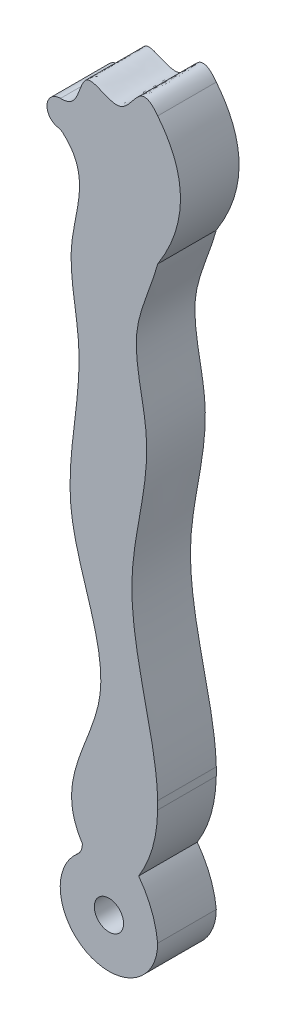
ISO-10303-21;
HEADER;
FILE_DESCRIPTION(('STEP AP214'),'2;1');
FILE_NAME('part.step','',(''),(''),'','','');
FILE_SCHEMA(('AUTOMOTIVE_DESIGN { 1 0 10303 214 1 1 1 1 }'));
ENDSEC;
DATA;
#1=APPLICATION_CONTEXT('core data for automotive mechanical design processes');
#2=APPLICATION_PROTOCOL_DEFINITION('international standard','automotive_design',2000,#1);
#3=PRODUCT_CONTEXT('',#1,'mechanical');
#4=PRODUCT('Part','Part','',(#3));
#5=PRODUCT_RELATED_PRODUCT_CATEGORY('part','',(#4));
#6=PRODUCT_DEFINITION_FORMATION('','',#4);
#7=PRODUCT_DEFINITION_CONTEXT('part definition',#1,'design');
#8=PRODUCT_DEFINITION('design','',#6,#7);
#9=PRODUCT_DEFINITION_SHAPE('','',#8);
#10=(LENGTH_UNIT() NAMED_UNIT(*) SI_UNIT(.MILLI.,.METRE.));
#11=(NAMED_UNIT(*) PLANE_ANGLE_UNIT() SI_UNIT($,.RADIAN.));
#12=(NAMED_UNIT(*) SI_UNIT($,.STERADIAN.) SOLID_ANGLE_UNIT());
#13=UNCERTAINTY_MEASURE_WITH_UNIT(LENGTH_MEASURE(1.E-05),#10,'distance_accuracy_value','');
#14=(GEOMETRIC_REPRESENTATION_CONTEXT(3) GLOBAL_UNCERTAINTY_ASSIGNED_CONTEXT((#13)) GLOBAL_UNIT_ASSIGNED_CONTEXT((#10,
#11,#12)) REPRESENTATION_CONTEXT('',''));
#15=CARTESIAN_POINT('',(0.,0.,0.));
#16=DIRECTION('',(0.,0.,1.));
#17=DIRECTION('',(1.,0.,0.));
#18=AXIS2_PLACEMENT_3D('',#15,#16,#17);
#19=CARTESIAN_POINT('',(4.07432307287909,27.0040889400727,6.));
#20=DIRECTION('',(0.,0.,1.));
#21=DIRECTION('',(1.,0.,0.));
#22=AXIS2_PLACEMENT_3D('',#19,#20,#21);
#23=PLANE('',#22);
#24=CARTESIAN_POINT('',(0.,62.2324417946878,6.));
#25=CARTESIAN_POINT('',(-5.4959859390498,67.6801144413468,6.));
#26=CARTESIAN_POINT('',(1.77784227078991,62.1497512946908,6.));
#27=CARTESIAN_POINT('',(2.17038944781153,69.5244424730461,6.));
#28=CARTESIAN_POINT('',(6.33422533234215,65.8803141578345,6.));
#29=CARTESIAN_POINT('',(8.75090615405241,71.7453502859519,6.));
#30=CARTESIAN_POINT('',(11.6370808342552,65.7664695238435,6.));
#31=CARTESIAN_POINT('',(10.6270973003878,61.0906304265352,6.));
#32=CARTESIAN_POINT('',(10.6985741308354,55.300297406717,6.));
#33=CARTESIAN_POINT('',(6.65358503860922,47.8374528915359,6.));
#34=CARTESIAN_POINT('',(10.1968985198345,37.8621664435148,6.));
#35=CARTESIAN_POINT('',(6.2416899898282,27.042244628002,6.));
#36=CARTESIAN_POINT('',(9.11488998657651,13.8196019973083,6.));
#37=CARTESIAN_POINT('',(11.1029015631119,4.96995196040314,6.));
#38=CARTESIAN_POINT('',(8.03193365572887,0.,6.));
#39=B_SPLINE_CURVE_WITH_KNOTS('',3,(#24,#25,#26,#27,#28,#29,#30,#31,#32,#33,#34,#35,#36,#37,
#38),.UNSPECIFIED.,.F.,.F.,(4,1,1,1,1,1,1,1,1,1,1,1,4),(0.,0.0767619654576642,0.113053263319761,
0.151244452951099,0.185874875582044,0.251290880121255,0.264745850391784,0.357225347832321,
0.442609394194228,0.541315829846449,0.695856348369289,0.81819230701639,1.),.UNSPECIFIED.);
#40=CARTESIAN_POINT('',(0.0277689813266729,64.9508332308169,6.));
#41=VERTEX_POINT('',#40);
#42=CARTESIAN_POINT('',(9.98000000001157,68.3690859599032,6.));
#43=VERTEX_POINT('',#42);
#44=EDGE_CURVE('E307',#41,#43,#39,.T.);
#45=ORIENTED_EDGE('',*,*,#44,.F.);
#46=CARTESIAN_POINT('',(0.,63.5917793459524,6.));
#47=DIRECTION('',(0.,0.,-1.));
#48=DIRECTION('',(-2.38735085553845E-11,1.,0.));
#49=AXIS2_PLACEMENT_3D('',#46,#47,#48);
#50=CIRCLE('',#49,1.35933755126867);
#51=CARTESIAN_POINT('',(-3.2452068376375E-11,64.9511168972211,6.));
#52=VERTEX_POINT('',#51);
#53=EDGE_CURVE('E314',#52,#41,#50,.T.);
#54=ORIENTED_EDGE('',*,*,#53,.F.);
#55=CARTESIAN_POINT('',(0.,63.5917793459524,6.));
#56=DIRECTION('',(0.,0.,1.));
#57=DIRECTION('',(1.,0.,0.));
#58=AXIS2_PLACEMENT_3D('',#55,#56,#57);
#59=CIRCLE('',#58,1.35933755126867);
#60=CARTESIAN_POINT('',(-0.228256869035137,62.251743010614,6.));
#61=VERTEX_POINT('',#60);
#62=EDGE_CURVE('E210',#52,#61,#59,.T.);
#63=ORIENTED_EDGE('',*,*,#62,.T.);
#64=CARTESIAN_POINT('',(-0.396174593975572,61.2659419974014,6.));
#65=DIRECTION('',(0.,0.,1.));
#66=DIRECTION('',(1.,0.,0.));
#67=AXIS2_PLACEMENT_3D('',#64,#65,#66);
#68=CIRCLE('',#67,1.);
#69=CARTESIAN_POINT('',(0.255036230191736,62.0248388695042,6.));
#70=VERTEX_POINT('',#69);
#71=EDGE_CURVE('E12',#61,#70,#68,.F.);
#72=ORIENTED_EDGE('',*,*,#71,.T.);
#73=CARTESIAN_POINT('',(0.,62.2324417946878,6.));
#74=CARTESIAN_POINT('',(3.36607697516246,59.6303807537117,6.));
#75=CARTESIAN_POINT('',(-0.0731511251895493,53.0249496597654,6.));
#76=CARTESIAN_POINT('',(3.17509222774821,41.8359679844712,6.));
#77=CARTESIAN_POINT('',(-1.20600701095314,28.7115908070452,6.));
#78=CARTESIAN_POINT('',(7.60981717895908,13.9982611143876,6.));
#79=CARTESIAN_POINT('',(-0.756937769432223,4.62163978623446,6.));
#80=CARTESIAN_POINT('',(2.25896504651037,0.,6.));
#81=B_SPLINE_CURVE_WITH_KNOTS('',3,(#73,#74,#75,#76,#77,#78,#79,#80),.UNSPECIFIED.,.F.,.F.,(4,1,
1,1,1,4),(0.,0.16160422746605,0.294432119216936,0.53676649334318,0.773956454146548,1.),.UNSPECIFIED.);
#82=CARTESIAN_POINT('',(2.25896504651037,0.,6.));
#83=VERTEX_POINT('',#82);
#84=EDGE_CURVE('E261',#70,#83,#81,.T.);
#85=ORIENTED_EDGE('',*,*,#84,.T.);
#86=CARTESIAN_POINT('',(0.794425581353111,-0.0820581520512793,6.));
#87=DIRECTION('',(0.,0.,1.));
#88=DIRECTION('',(1.,0.,0.));
#89=AXIS2_PLACEMENT_3D('',#86,#87,#88);
#90=CIRCLE('',#89,1.46683652303901);
#91=CARTESIAN_POINT('',(1.74755824476192,-1.19702340319788,6.));
#92=VERTEX_POINT('',#91);
#93=EDGE_CURVE('E254',#92,#83,#90,.T.);
#94=ORIENTED_EDGE('',*,*,#93,.F.);
#95=CARTESIAN_POINT('',(4.99,-4.99,6.));
#96=DIRECTION('',(0.,0.,-1.));
#97=DIRECTION('',(-1.,0.,0.));
#98=AXIS2_PLACEMENT_3D('',#95,#96,#97);
#99=CIRCLE('',#98,4.99);
#100=CARTESIAN_POINT('',(9.98,-4.99,6.));
#101=VERTEX_POINT('',#100);
#102=EDGE_CURVE('E352',#101,#92,#99,.T.);
#103=ORIENTED_EDGE('',*,*,#102,.F.);
#104=CARTESIAN_POINT('',(0.0310108964638543,-5.99876945716995,6.));
#105=DIRECTION('',(0.,0.,1.));
#106=DIRECTION('',(1.,0.,0.));
#107=AXIS2_PLACEMENT_3D('',#104,#105,#106);
#108=CIRCLE('',#107,10.);
#109=CARTESIAN_POINT('',(8.03193365572887,0.,6.));
#110=VERTEX_POINT('',#109);
#111=EDGE_CURVE('E366',#101,#110,#108,.T.);
#112=ORIENTED_EDGE('',*,*,#111,.T.);
#113=CARTESIAN_POINT('',(9.98,6.82520610967034,6.));
#114=VERTEX_POINT('',#113);
#115=EDGE_CURVE('E266',#114,#110,#39,.T.);
#116=ORIENTED_EDGE('',*,*,#115,.F.);
#117=DIRECTION('',(0.,1.,0.));
#118=VECTOR('',#117,1.);
#119=CARTESIAN_POINT('',(9.98,0.,6.));
#120=LINE('',#119,#118);
#121=CARTESIAN_POINT('',(9.98,7.6512733883992,6.));
#122=VERTEX_POINT('',#121);
#123=EDGE_CURVE('E346',#114,#122,#120,.T.);
#124=ORIENTED_EDGE('',*,*,#123,.T.);
#125=CARTESIAN_POINT('',(9.98000000001378,55.2433559985158,6.));
#126=VERTEX_POINT('',#125);
#127=EDGE_CURVE('E315',#126,#122,#39,.T.);
#128=ORIENTED_EDGE('',*,*,#127,.F.);
#129=CARTESIAN_POINT('',(9.98000000001378,55.2433559985158,6.));
#130=CARTESIAN_POINT('',(14.6468595697322,62.5673970217794,6.));
#131=CARTESIAN_POINT('',(9.98000000001157,68.3690859599032,6.));
#132=B_SPLINE_CURVE_WITH_KNOTS('',2,(#129,#130,#131),.UNSPECIFIED.,.F.,.F.,(3,3),(0.,1.),.UNSPECIFIED.);
#133=EDGE_CURVE('E203',#126,#43,#132,.T.);
#134=ORIENTED_EDGE('',*,*,#133,.T.);
#135=EDGE_LOOP('',(#45,#54,#63,#72,#85,#94,#103,#112,#116,#124,#128,#134));
#136=FACE_BOUND('',#135,.T.);
#137=CARTESIAN_POINT('',(4.99,-4.99,6.));
#138=DIRECTION('',(0.,0.,1.));
#139=DIRECTION('',(1.,0.,0.));
#140=AXIS2_PLACEMENT_3D('',#137,#138,#139);
#141=CIRCLE('',#140,1.5);
#142=CARTESIAN_POINT('',(6.49,-4.99,6.));
#143=VERTEX_POINT('',#142);
#144=EDGE_CURVE('E359',#143,#143,#141,.T.);
#145=ORIENTED_EDGE('',*,*,#144,.F.);
#146=EDGE_LOOP('',(#145));
#147=FACE_BOUND('',#146,.T.);
#148=ADVANCED_FACE('F97',(#136,#147),#23,.T.);
#149=CARTESIAN_POINT('',(4.07432307287909,27.0040889400727,0.));
#150=DIRECTION('',(0.,0.,1.));
#151=DIRECTION('',(1.,0.,0.));
#152=AXIS2_PLACEMENT_3D('',#149,#150,#151);
#153=PLANE('',#152);
#154=CARTESIAN_POINT('',(4.99,-4.99,0.));
#155=DIRECTION('',(0.,0.,1.));
#156=DIRECTION('',(1.,0.,0.));
#157=AXIS2_PLACEMENT_3D('',#154,#155,#156);
#158=CIRCLE('',#157,1.5);
#159=CARTESIAN_POINT('',(6.49,-4.99,0.));
#160=VERTEX_POINT('',#159);
#161=EDGE_CURVE('E358',#160,#160,#158,.T.);
#162=ORIENTED_EDGE('',*,*,#161,.T.);
#163=EDGE_LOOP('',(#162));
#164=FACE_BOUND('',#163,.T.);
#165=CARTESIAN_POINT('',(0.,62.2324417946878,0.));
#166=CARTESIAN_POINT('',(3.36607697516246,59.6303807537117,0.));
#167=CARTESIAN_POINT('',(-0.0731511251895493,53.0249496597654,0.));
#168=CARTESIAN_POINT('',(3.17509222774821,41.8359679844712,0.));
#169=CARTESIAN_POINT('',(-1.20600701095314,28.7115908070452,0.));
#170=CARTESIAN_POINT('',(7.60981717895908,13.9982611143876,0.));
#171=CARTESIAN_POINT('',(-0.756937769432223,4.62163978623446,0.));
#172=CARTESIAN_POINT('',(2.25896504651037,0.,0.));
#173=B_SPLINE_CURVE_WITH_KNOTS('',3,(#165,#166,#167,#168,#169,#170,#171,#172),.UNSPECIFIED.,.F.,
.F.,(4,1,1,1,1,4),(0.,0.16160422746605,0.294432119216936,0.53676649334318,0.773956454146548,1.),.UNSPECIFIED.);
#174=CARTESIAN_POINT('',(0.255036230191736,62.0248388695042,0.));
#175=VERTEX_POINT('',#174);
#176=CARTESIAN_POINT('',(2.25896504651037,0.,0.));
#177=VERTEX_POINT('',#176);
#178=EDGE_CURVE('E260',#175,#177,#173,.T.);
#179=ORIENTED_EDGE('',*,*,#178,.F.);
#180=CARTESIAN_POINT('',(-0.396174593975572,61.2659419974014,0.));
#181=DIRECTION('',(0.,0.,1.));
#182=DIRECTION('',(1.,0.,0.));
#183=AXIS2_PLACEMENT_3D('',#180,#181,#182);
#184=CIRCLE('',#183,1.);
#185=CARTESIAN_POINT('',(-0.228256869035137,62.251743010614,0.));
#186=VERTEX_POINT('',#185);
#187=EDGE_CURVE('E105',#175,#186,#184,.T.);
#188=ORIENTED_EDGE('',*,*,#187,.T.);
#189=CARTESIAN_POINT('',(0.,63.5917793459524,0.));
#190=DIRECTION('',(0.,0.,1.));
#191=DIRECTION('',(1.,0.,0.));
#192=AXIS2_PLACEMENT_3D('',#189,#190,#191);
#193=CIRCLE('',#192,1.35933755126867);
#194=CARTESIAN_POINT('',(-3.2452068376375E-11,64.9511168972211,0.));
#195=VERTEX_POINT('',#194);
#196=EDGE_CURVE('E212',#195,#186,#193,.T.);
#197=ORIENTED_EDGE('',*,*,#196,.F.);
#198=CARTESIAN_POINT('',(0.,64.9511168972172,0.));
#199=DIRECTION('',(0.99994782866692,-0.0102146925705664,0.));
#200=VECTOR('',#199,1.);
#201=LINE('',#198,#200);
#202=CARTESIAN_POINT('',(0.0277689813266729,64.9508332308169,0.));
#203=VERTEX_POINT('',#202);
#204=EDGE_CURVE('E267',#195,#203,#201,.T.);
#205=ORIENTED_EDGE('',*,*,#204,.T.);
#206=CARTESIAN_POINT('',(0.,62.2324417946878,0.));
#207=CARTESIAN_POINT('',(-5.4959859390498,67.6801144413468,0.));
#208=CARTESIAN_POINT('',(1.77784227078991,62.1497512946908,0.));
#209=CARTESIAN_POINT('',(2.17038944781153,69.5244424730461,0.));
#210=CARTESIAN_POINT('',(6.33422533234215,65.8803141578345,0.));
#211=CARTESIAN_POINT('',(8.75090615405241,71.7453502859519,0.));
#212=CARTESIAN_POINT('',(11.6370808342552,65.7664695238435,0.));
#213=CARTESIAN_POINT('',(10.6270973003878,61.0906304265352,0.));
#214=CARTESIAN_POINT('',(10.6985741308354,55.300297406717,0.));
#215=CARTESIAN_POINT('',(6.65358503860922,47.8374528915359,0.));
#216=CARTESIAN_POINT('',(10.1968985198345,37.8621664435148,0.));
#217=CARTESIAN_POINT('',(6.2416899898282,27.042244628002,0.));
#218=CARTESIAN_POINT('',(9.11488998657651,13.8196019973083,0.));
#219=CARTESIAN_POINT('',(11.1029015631119,4.96995196040314,0.));
#220=CARTESIAN_POINT('',(8.03193365572887,0.,0.));
#221=B_SPLINE_CURVE_WITH_KNOTS('',3,(#206,#207,#208,#209,#210,#211,#212,#213,#214,#215,#216,
#217,#218,#219,#220),.UNSPECIFIED.,.F.,.F.,(4,1,1,1,1,1,1,1,1,1,1,1,4),(0.,0.0767619654576642,
0.113053263319761,0.151244452951099,0.185874875582044,0.251290880121255,0.264745850391784,
0.357225347832321,0.442609394194228,0.541315829846449,0.695856348369289,0.81819230701639,1.),.UNSPECIFIED.);
#222=CARTESIAN_POINT('',(9.98000000001157,68.3690859599032,0.));
#223=VERTEX_POINT('',#222);
#224=EDGE_CURVE('E193',#203,#223,#221,.T.);
#225=ORIENTED_EDGE('',*,*,#224,.T.);
#226=CARTESIAN_POINT('',(9.98000000001378,55.2433559985158,0.));
#227=CARTESIAN_POINT('',(14.6468595697322,62.5673970217794,0.));
#228=CARTESIAN_POINT('',(9.98000000001157,68.3690859599032,0.));
#229=B_SPLINE_CURVE_WITH_KNOTS('',2,(#226,#227,#228),.UNSPECIFIED.,.F.,.F.,(3,3),(0.,1.),.UNSPECIFIED.);
#230=CARTESIAN_POINT('',(9.98000000001378,55.2433559985158,0.));
#231=VERTEX_POINT('',#230);
#232=EDGE_CURVE('E201',#231,#223,#229,.T.);
#233=ORIENTED_EDGE('',*,*,#232,.F.);
#234=CARTESIAN_POINT('',(9.97999999999998,7.65127338839919,0.));
#235=VERTEX_POINT('',#234);
#236=EDGE_CURVE('E183',#231,#235,#221,.T.);
#237=ORIENTED_EDGE('',*,*,#236,.T.);
#238=DIRECTION('',(0.,1.,0.));
#239=VECTOR('',#238,1.);
#240=CARTESIAN_POINT('',(9.98,0.,0.));
#241=LINE('',#240,#239);
#242=CARTESIAN_POINT('',(9.98,6.82520610967034,0.));
#243=VERTEX_POINT('',#242);
#244=EDGE_CURVE('E347',#243,#235,#241,.T.);
#245=ORIENTED_EDGE('',*,*,#244,.F.);
#246=CARTESIAN_POINT('',(8.03193365572887,0.,0.));
#247=VERTEX_POINT('',#246);
#248=EDGE_CURVE('E194',#243,#247,#221,.T.);
#249=ORIENTED_EDGE('',*,*,#248,.T.);
#250=CARTESIAN_POINT('',(0.0310108964638543,-5.99876945716995,0.));
#251=DIRECTION('',(0.,0.,1.));
#252=DIRECTION('',(1.,0.,0.));
#253=AXIS2_PLACEMENT_3D('',#250,#251,#252);
#254=CIRCLE('',#253,10.);
#255=CARTESIAN_POINT('',(9.98,-4.99,0.));
#256=VERTEX_POINT('',#255);
#257=EDGE_CURVE('E362',#247,#256,#254,.F.);
#258=ORIENTED_EDGE('',*,*,#257,.T.);
#259=CARTESIAN_POINT('',(4.99,-4.99,0.));
#260=DIRECTION('',(0.,0.,-1.));
#261=DIRECTION('',(-1.,0.,0.));
#262=AXIS2_PLACEMENT_3D('',#259,#260,#261);
#263=CIRCLE('',#262,4.99);
#264=CARTESIAN_POINT('',(1.74755824476192,-1.19702340319788,0.));
#265=VERTEX_POINT('',#264);
#266=EDGE_CURVE('E349',#256,#265,#263,.T.);
#267=ORIENTED_EDGE('',*,*,#266,.T.);
#268=CARTESIAN_POINT('',(0.794425581353111,-0.0820581520512793,0.));
#269=DIRECTION('',(0.,0.,1.));
#270=DIRECTION('',(1.,0.,0.));
#271=AXIS2_PLACEMENT_3D('',#268,#269,#270);
#272=CIRCLE('',#271,1.46683652303901);
#273=EDGE_CURVE('E245',#265,#177,#272,.T.);
#274=ORIENTED_EDGE('',*,*,#273,.T.);
#275=EDGE_LOOP('',(#179,#188,#197,#205,#225,#233,#237,#245,#249,#258,#267,#274));
#276=FACE_BOUND('',#275,.T.);
#277=ADVANCED_FACE('F206',(#164,#276),#153,.F.);
#278=CARTESIAN_POINT('',(9.98,0.,0.));
#279=DIRECTION('',(1.,0.,0.));
#280=DIRECTION('',(0.,1.,0.));
#281=AXIS2_PLACEMENT_3D('',#278,#279,#280);
#282=PLANE('',#281);
#283=ORIENTED_EDGE('',*,*,#244,.T.);
#284=DIRECTION('',(0.,0.,-1.));
#285=VECTOR('',#284,1.);
#286=CARTESIAN_POINT('',(9.98,7.65127338839836,6.));
#287=LINE('',#286,#285);
#288=EDGE_CURVE('E189',#235,#122,#287,.F.);
#289=ORIENTED_EDGE('',*,*,#288,.T.);
#290=ORIENTED_EDGE('',*,*,#123,.F.);
#291=DIRECTION('',(0.,0.,-1.));
#292=VECTOR('',#291,1.);
#293=CARTESIAN_POINT('',(9.98,6.82520610967016,6.));
#294=LINE('',#293,#292);
#295=EDGE_CURVE('E341',#114,#243,#294,.T.);
#296=ORIENTED_EDGE('',*,*,#295,.T.);
#297=EDGE_LOOP('',(#283,#289,#290,#296));
#298=FACE_BOUND('',#297,.T.);
#299=ADVANCED_FACE('F282',(#298),#282,.T.);
#300=CARTESIAN_POINT('',(4.99,-4.99,6.));
#301=DIRECTION('',(0.,0.,-1.));
#302=DIRECTION('',(-1.,0.,0.));
#303=AXIS2_PLACEMENT_3D('',#300,#301,#302);
#304=CYLINDRICAL_SURFACE('',#303,1.5);
#305=ORIENTED_EDGE('',*,*,#144,.T.);
#306=EDGE_LOOP('',(#305));
#307=FACE_BOUND('',#306,.T.);
#308=ORIENTED_EDGE('',*,*,#161,.F.);
#309=EDGE_LOOP('',(#308));
#310=FACE_BOUND('',#309,.T.);
#311=ADVANCED_FACE('F285',(#307,#310),#304,.F.);
#312=CARTESIAN_POINT('',(4.99,-4.99,6.));
#313=DIRECTION('',(0.,0.,-1.));
#314=DIRECTION('',(-1.,0.,0.));
#315=AXIS2_PLACEMENT_3D('',#312,#313,#314);
#316=CYLINDRICAL_SURFACE('',#315,4.99);
#317=ORIENTED_EDGE('',*,*,#102,.T.);
#318=DIRECTION('',(0.,0.,1.));
#319=VECTOR('',#318,1.);
#320=CARTESIAN_POINT('',(1.74755824476192,-1.19702340319788,0.));
#321=LINE('',#320,#319);
#322=EDGE_CURVE('E253',#265,#92,#321,.T.);
#323=ORIENTED_EDGE('',*,*,#322,.F.);
#324=ORIENTED_EDGE('',*,*,#266,.F.);
#325=DIRECTION('',(0.,0.,-1.));
#326=VECTOR('',#325,1.);
#327=CARTESIAN_POINT('',(9.98,-4.99,6.));
#328=LINE('',#327,#326);
#329=EDGE_CURVE('E354',#101,#256,#328,.T.);
#330=ORIENTED_EDGE('',*,*,#329,.F.);
#331=EDGE_LOOP('',(#317,#323,#324,#330));
#332=FACE_BOUND('',#331,.T.);
#333=ADVANCED_FACE('F287',(#332),#316,.T.);
#334=CARTESIAN_POINT('',(0.0310108964638543,-5.99876945716995,3.));
#335=DIRECTION('',(0.,0.,1.));
#336=DIRECTION('',(1.,0.,0.));
#337=AXIS2_PLACEMENT_3D('',#334,#335,#336);
#338=CYLINDRICAL_SURFACE('',#337,10.);
#339=DIRECTION('',(0.,0.,1.));
#340=VECTOR('',#339,1.);
#341=CARTESIAN_POINT('',(8.03193365572887,0.,3.));
#342=LINE('',#341,#340);
#343=EDGE_CURVE('E369',#110,#247,#342,.F.);
#344=ORIENTED_EDGE('',*,*,#343,.F.);
#345=ORIENTED_EDGE('',*,*,#111,.F.);
#346=ORIENTED_EDGE('',*,*,#329,.T.);
#347=ORIENTED_EDGE('',*,*,#257,.F.);
#348=EDGE_LOOP('',(#344,#345,#346,#347));
#349=FACE_BOUND('',#348,.T.);
#350=ADVANCED_FACE('F290',(#349),#338,.T.);
#351=DIRECTION('',(0.,0.,-1.));
#352=VECTOR('',#351,1.);
#353=SURFACE_OF_LINEAR_EXTRUSION('',#39,#352);
#354=DIRECTION('',(0.,0.,-1.));
#355=VECTOR('',#354,1.);
#356=CARTESIAN_POINT('',(0.0277689813265465,64.9508332308107,6.));
#357=LINE('',#356,#355);
#358=EDGE_CURVE('E257',#41,#203,#357,.T.);
#359=ORIENTED_EDGE('',*,*,#358,.F.);
#360=ORIENTED_EDGE('',*,*,#44,.T.);
#361=DIRECTION('',(0.,0.,-1.));
#362=VECTOR('',#361,1.);
#363=CARTESIAN_POINT('',(9.97999999999999,68.36908595992,6.));
#364=LINE('',#363,#362);
#365=EDGE_CURVE('E204',#223,#43,#364,.F.);
#366=ORIENTED_EDGE('',*,*,#365,.F.);
#367=ORIENTED_EDGE('',*,*,#224,.F.);
#368=EDGE_LOOP('',(#359,#360,#366,#367));
#369=FACE_BOUND('',#368,.T.);
#370=ADVANCED_FACE('F280',(#369),#353,.T.);
#371=DIRECTION('',(0.,0.,-1.));
#372=VECTOR('',#371,1.);
#373=SURFACE_OF_LINEAR_EXTRUSION('',#81,#372);
#374=ORIENTED_EDGE('',*,*,#84,.F.);
#375=DIRECTION('',(0.,0.,-1.));
#376=VECTOR('',#375,1.);
#377=CARTESIAN_POINT('',(0.255036230191735,62.0248388695042,6.));
#378=LINE('',#377,#376);
#379=EDGE_CURVE('E326',#70,#175,#378,.T.);
#380=ORIENTED_EDGE('',*,*,#379,.T.);
#381=ORIENTED_EDGE('',*,*,#178,.T.);
#382=DIRECTION('',(0.,0.,-1.));
#383=VECTOR('',#382,1.);
#384=CARTESIAN_POINT('',(2.25896504651037,0.,6.));
#385=LINE('',#384,#383);
#386=EDGE_CURVE('E335',#83,#177,#385,.T.);
#387=ORIENTED_EDGE('',*,*,#386,.F.);
#388=EDGE_LOOP('',(#374,#380,#381,#387));
#389=FACE_BOUND('',#388,.T.);
#390=ADVANCED_FACE('F276',(#389),#373,.F.);
#391=ORIENTED_EDGE('',*,*,#115,.T.);
#392=ORIENTED_EDGE('',*,*,#343,.T.);
#393=ORIENTED_EDGE('',*,*,#248,.F.);
#394=ORIENTED_EDGE('',*,*,#295,.F.);
#395=EDGE_LOOP('',(#391,#392,#393,#394));
#396=FACE_BOUND('',#395,.T.);
#397=ADVANCED_FACE('F279',(#396),#353,.T.);
#398=ORIENTED_EDGE('',*,*,#127,.T.);
#399=ORIENTED_EDGE('',*,*,#288,.F.);
#400=ORIENTED_EDGE('',*,*,#236,.F.);
#401=DIRECTION('',(0.,0.,-1.));
#402=VECTOR('',#401,1.);
#403=CARTESIAN_POINT('',(9.97999999999999,55.2433559984627,6.));
#404=LINE('',#403,#402);
#405=EDGE_CURVE('E186',#126,#231,#404,.T.);
#406=ORIENTED_EDGE('',*,*,#405,.F.);
#407=EDGE_LOOP('',(#398,#399,#400,#406));
#408=FACE_BOUND('',#407,.T.);
#409=ADVANCED_FACE('F185',(#408),#353,.T.);
#410=CARTESIAN_POINT('',(0.794425581353111,-0.0820581520512793,0.));
#411=DIRECTION('',(0.,0.,1.));
#412=DIRECTION('',(1.,0.,0.));
#413=AXIS2_PLACEMENT_3D('',#410,#411,#412);
#414=CYLINDRICAL_SURFACE('',#413,1.46683652303901);
#415=ORIENTED_EDGE('',*,*,#93,.T.);
#416=ORIENTED_EDGE('',*,*,#386,.T.);
#417=ORIENTED_EDGE('',*,*,#273,.F.);
#418=ORIENTED_EDGE('',*,*,#322,.T.);
#419=EDGE_LOOP('',(#415,#416,#417,#418));
#420=FACE_BOUND('',#419,.T.);
#421=ADVANCED_FACE('F231',(#420),#414,.F.);
#422=CARTESIAN_POINT('',(0.,63.5917793459524,0.));
#423=DIRECTION('',(0.,0.,1.));
#424=DIRECTION('',(1.,0.,0.));
#425=AXIS2_PLACEMENT_3D('',#422,#423,#424);
#426=CYLINDRICAL_SURFACE('',#425,1.35933755126867);
#427=ORIENTED_EDGE('',*,*,#196,.T.);
#428=DIRECTION('',(0.,0.,1.));
#429=VECTOR('',#428,1.);
#430=CARTESIAN_POINT('',(-0.228256869035137,62.251743010614,0.));
#431=LINE('',#430,#429);
#432=EDGE_CURVE('E118',#186,#61,#431,.T.);
#433=ORIENTED_EDGE('',*,*,#432,.T.);
#434=ORIENTED_EDGE('',*,*,#62,.F.);
#435=ORIENTED_EDGE('',*,*,#53,.T.);
#436=ORIENTED_EDGE('',*,*,#358,.T.);
#437=ORIENTED_EDGE('',*,*,#204,.F.);
#438=EDGE_LOOP('',(#427,#433,#434,#435,#436,#437));
#439=FACE_BOUND('',#438,.T.);
#440=ADVANCED_FACE('F227',(#439),#426,.T.);
#441=DIRECTION('',(0.,0.,1.));
#442=VECTOR('',#441,1.);
#443=SURFACE_OF_LINEAR_EXTRUSION('',#229,#442);
#444=ORIENTED_EDGE('',*,*,#133,.F.);
#445=ORIENTED_EDGE('',*,*,#405,.T.);
#446=ORIENTED_EDGE('',*,*,#232,.T.);
#447=ORIENTED_EDGE('',*,*,#365,.T.);
#448=EDGE_LOOP('',(#444,#445,#446,#447));
#449=FACE_BOUND('',#448,.T.);
#450=ADVANCED_FACE('F199',(#449),#443,.T.);
#451=CARTESIAN_POINT('',(-0.396174593975572,61.2659419974014,3.));
#452=DIRECTION('',(0.,0.,-1.));
#453=DIRECTION('',(-1.,0.,0.));
#454=AXIS2_PLACEMENT_3D('',#451,#452,#453);
#455=CYLINDRICAL_SURFACE('',#454,1.);
#456=ORIENTED_EDGE('',*,*,#71,.F.);
#457=ORIENTED_EDGE('',*,*,#432,.F.);
#458=ORIENTED_EDGE('',*,*,#187,.F.);
#459=ORIENTED_EDGE('',*,*,#379,.F.);
#460=EDGE_LOOP('',(#456,#457,#458,#459));
#461=FACE_BOUND('',#460,.T.);
#462=ADVANCED_FACE('F99',(#461),#455,.F.);
#463=CLOSED_SHELL('',(#148,#277,#299,#311,#333,#350,#370,#390,#397,#409,#421,#440,#450,#462));
#464=MANIFOLD_SOLID_BREP('B2',#463);
#465=ADVANCED_BREP_SHAPE_REPRESENTATION('',(#18,#464),#14);
#466=SHAPE_DEFINITION_REPRESENTATION(#9,#465);
ENDSEC;
END-ISO-10303-21;
